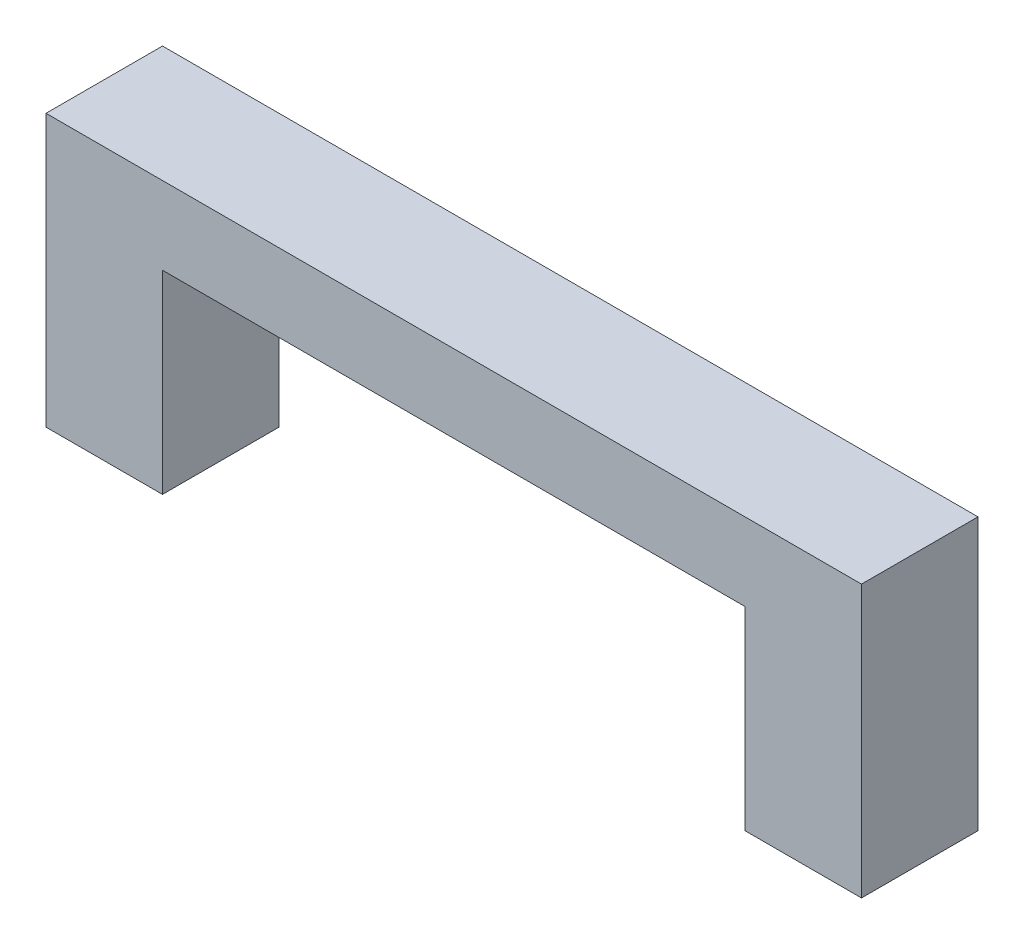
ISO-10303-21;
HEADER;
FILE_DESCRIPTION(('STEP AP214'),'2;1');
FILE_NAME('part.step','',(''),(''),'','','');
FILE_SCHEMA(('AUTOMOTIVE_DESIGN { 1 0 10303 214 1 1 1 1 }'));
ENDSEC;
DATA;
#1=APPLICATION_CONTEXT('core data for automotive mechanical design processes');
#2=APPLICATION_PROTOCOL_DEFINITION('international standard','automotive_design',2000,#1);
#3=PRODUCT_CONTEXT('',#1,'mechanical');
#4=PRODUCT('Part','Part','',(#3));
#5=PRODUCT_RELATED_PRODUCT_CATEGORY('part','',(#4));
#6=PRODUCT_DEFINITION_FORMATION('','',#4);
#7=PRODUCT_DEFINITION_CONTEXT('part definition',#1,'design');
#8=PRODUCT_DEFINITION('design','',#6,#7);
#9=PRODUCT_DEFINITION_SHAPE('','',#8);
#10=(LENGTH_UNIT() NAMED_UNIT(*) SI_UNIT(.MILLI.,.METRE.));
#11=(NAMED_UNIT(*) PLANE_ANGLE_UNIT() SI_UNIT($,.RADIAN.));
#12=(NAMED_UNIT(*) SI_UNIT($,.STERADIAN.) SOLID_ANGLE_UNIT());
#13=UNCERTAINTY_MEASURE_WITH_UNIT(LENGTH_MEASURE(1.E-05),#10,'distance_accuracy_value','');
#14=(GEOMETRIC_REPRESENTATION_CONTEXT(3) GLOBAL_UNCERTAINTY_ASSIGNED_CONTEXT((#13)) GLOBAL_UNIT_ASSIGNED_CONTEXT((#10,
#11,#12)) REPRESENTATION_CONTEXT('',''));
#15=CARTESIAN_POINT('',(0.,0.,0.));
#16=DIRECTION('',(0.,0.,1.));
#17=DIRECTION('',(1.,0.,0.));
#18=AXIS2_PLACEMENT_3D('',#15,#16,#17);
#19=CARTESIAN_POINT('',(21.,0.,3.));
#20=DIRECTION('',(0.,1.,0.));
#21=DIRECTION('',(-1.,0.,0.));
#22=AXIS2_PLACEMENT_3D('',#19,#20,#21);
#23=PLANE('',#22);
#24=DIRECTION('',(1.,0.,0.));
#25=VECTOR('',#24,1.);
#26=CARTESIAN_POINT('',(21.,0.,0.));
#27=LINE('',#26,#25);
#28=CARTESIAN_POINT('',(18.,0.,0.));
#29=VERTEX_POINT('',#28);
#30=CARTESIAN_POINT('',(21.,0.,0.));
#31=VERTEX_POINT('',#30);
#32=EDGE_CURVE('E236',#29,#31,#27,.T.);
#33=ORIENTED_EDGE('',*,*,#32,.T.);
#34=DIRECTION('',(0.,0.,-1.));
#35=VECTOR('',#34,1.);
#36=CARTESIAN_POINT('',(21.,0.,3.));
#37=LINE('',#36,#35);
#38=CARTESIAN_POINT('',(21.,0.,3.));
#39=VERTEX_POINT('',#38);
#40=EDGE_CURVE('E251',#39,#31,#37,.T.);
#41=ORIENTED_EDGE('',*,*,#40,.F.);
#42=DIRECTION('',(1.,0.,0.));
#43=VECTOR('',#42,1.);
#44=CARTESIAN_POINT('',(21.,0.,3.));
#45=LINE('',#44,#43);
#46=CARTESIAN_POINT('',(18.,0.,3.));
#47=VERTEX_POINT('',#46);
#48=EDGE_CURVE('E219',#47,#39,#45,.T.);
#49=ORIENTED_EDGE('',*,*,#48,.F.);
#50=DIRECTION('',(0.,0.,-1.));
#51=VECTOR('',#50,1.);
#52=CARTESIAN_POINT('',(18.,0.,3.));
#53=LINE('',#52,#51);
#54=EDGE_CURVE('E254',#47,#29,#53,.T.);
#55=ORIENTED_EDGE('',*,*,#54,.T.);
#56=EDGE_LOOP('',(#33,#41,#49,#55));
#57=FACE_BOUND('',#56,.T.);
#58=DIRECTION('',(0.,0.,-1.));
#59=VECTOR('',#58,1.);
#60=CARTESIAN_POINT('',(20.5,0.,0.));
#61=LINE('',#60,#59);
#62=CARTESIAN_POINT('',(20.5,0.,2.5));
#63=VERTEX_POINT('',#62);
#64=CARTESIAN_POINT('',(20.5,0.,0.500000000000001));
#65=VERTEX_POINT('',#64);
#66=EDGE_CURVE('E56',#63,#65,#61,.T.);
#67=ORIENTED_EDGE('',*,*,#66,.T.);
#68=DIRECTION('',(1.,0.,0.));
#69=VECTOR('',#68,1.);
#70=CARTESIAN_POINT('',(0.,0.,0.500000000000001));
#71=LINE('',#70,#69);
#72=CARTESIAN_POINT('',(18.5,0.,0.500000000000001));
#73=VERTEX_POINT('',#72);
#74=EDGE_CURVE('E185',#73,#65,#71,.T.);
#75=ORIENTED_EDGE('',*,*,#74,.F.);
#76=DIRECTION('',(0.,0.,-1.));
#77=VECTOR('',#76,1.);
#78=CARTESIAN_POINT('',(18.5,0.,0.));
#79=LINE('',#78,#77);
#80=CARTESIAN_POINT('',(18.5,0.,2.5));
#81=VERTEX_POINT('',#80);
#82=EDGE_CURVE('E196',#81,#73,#79,.T.);
#83=ORIENTED_EDGE('',*,*,#82,.F.);
#84=DIRECTION('',(1.,0.,0.));
#85=VECTOR('',#84,1.);
#86=CARTESIAN_POINT('',(0.,0.,2.5));
#87=LINE('',#86,#85);
#88=EDGE_CURVE('E168',#81,#63,#87,.T.);
#89=ORIENTED_EDGE('',*,*,#88,.T.);
#90=EDGE_LOOP('',(#67,#75,#83,#89));
#91=FACE_BOUND('',#90,.T.);
#92=ADVANCED_FACE('F33',(#57,#91),#23,.F.);
#93=CARTESIAN_POINT('',(3.,0.,3.));
#94=DIRECTION('',(0.,1.,0.));
#95=DIRECTION('',(-1.,0.,0.));
#96=AXIS2_PLACEMENT_3D('',#93,#94,#95);
#97=PLANE('',#96);
#98=DIRECTION('',(1.,0.,0.));
#99=VECTOR('',#98,1.);
#100=CARTESIAN_POINT('',(0.5,0.,0.5));
#101=LINE('',#100,#99);
#102=CARTESIAN_POINT('',(0.5,0.,0.5));
#103=VERTEX_POINT('',#102);
#104=CARTESIAN_POINT('',(2.5,0.,0.5));
#105=VERTEX_POINT('',#104);
#106=EDGE_CURVE('E166',#103,#105,#101,.T.);
#107=ORIENTED_EDGE('',*,*,#106,.F.);
#108=DIRECTION('',(0.,0.,-1.));
#109=VECTOR('',#108,1.);
#110=CARTESIAN_POINT('',(0.5,0.,2.5));
#111=LINE('',#110,#109);
#112=CARTESIAN_POINT('',(0.5,0.,2.5));
#113=VERTEX_POINT('',#112);
#114=EDGE_CURVE('E48',#113,#103,#111,.T.);
#115=ORIENTED_EDGE('',*,*,#114,.F.);
#116=DIRECTION('',(1.,0.,0.));
#117=VECTOR('',#116,1.);
#118=CARTESIAN_POINT('',(0.5,0.,2.5));
#119=LINE('',#118,#117);
#120=CARTESIAN_POINT('',(2.5,0.,2.5));
#121=VERTEX_POINT('',#120);
#122=EDGE_CURVE('E155',#113,#121,#119,.T.);
#123=ORIENTED_EDGE('',*,*,#122,.T.);
#124=DIRECTION('',(0.,0.,-1.));
#125=VECTOR('',#124,1.);
#126=CARTESIAN_POINT('',(2.5,0.,2.5));
#127=LINE('',#126,#125);
#128=EDGE_CURVE('E161',#121,#105,#127,.T.);
#129=ORIENTED_EDGE('',*,*,#128,.T.);
#130=EDGE_LOOP('',(#107,#115,#123,#129));
#131=FACE_BOUND('',#130,.T.);
#132=DIRECTION('',(1.,0.,0.));
#133=VECTOR('',#132,1.);
#134=CARTESIAN_POINT('',(3.,0.,0.));
#135=LINE('',#134,#133);
#136=CARTESIAN_POINT('',(0.,0.,0.));
#137=VERTEX_POINT('',#136);
#138=CARTESIAN_POINT('',(3.,0.,0.));
#139=VERTEX_POINT('',#138);
#140=EDGE_CURVE('E203',#137,#139,#135,.T.);
#141=ORIENTED_EDGE('',*,*,#140,.T.);
#142=DIRECTION('',(0.,0.,-1.));
#143=VECTOR('',#142,1.);
#144=CARTESIAN_POINT('',(3.,0.,3.));
#145=LINE('',#144,#143);
#146=CARTESIAN_POINT('',(3.,0.,3.));
#147=VERTEX_POINT('',#146);
#148=EDGE_CURVE('E11',#147,#139,#145,.T.);
#149=ORIENTED_EDGE('',*,*,#148,.F.);
#150=DIRECTION('',(1.,0.,0.));
#151=VECTOR('',#150,1.);
#152=CARTESIAN_POINT('',(3.,0.,3.));
#153=LINE('',#152,#151);
#154=CARTESIAN_POINT('',(0.,0.,3.));
#155=VERTEX_POINT('',#154);
#156=EDGE_CURVE('E209',#155,#147,#153,.T.);
#157=ORIENTED_EDGE('',*,*,#156,.F.);
#158=DIRECTION('',(0.,0.,-1.));
#159=VECTOR('',#158,1.);
#160=CARTESIAN_POINT('',(0.,0.,3.));
#161=LINE('',#160,#159);
#162=EDGE_CURVE('E227',#155,#137,#161,.T.);
#163=ORIENTED_EDGE('',*,*,#162,.T.);
#164=EDGE_LOOP('',(#141,#149,#157,#163));
#165=FACE_BOUND('',#164,.T.);
#166=ADVANCED_FACE('F35',(#131,#165),#97,.F.);
#167=CARTESIAN_POINT('',(3.,5.,3.));
#168=DIRECTION('',(-1.,0.,0.));
#169=DIRECTION('',(0.,-1.,0.));
#170=AXIS2_PLACEMENT_3D('',#167,#168,#169);
#171=PLANE('',#170);
#172=DIRECTION('',(0.,1.,0.));
#173=VECTOR('',#172,1.);
#174=CARTESIAN_POINT('',(3.,5.,0.));
#175=LINE('',#174,#173);
#176=CARTESIAN_POINT('',(3.,5.,0.));
#177=VERTEX_POINT('',#176);
#178=EDGE_CURVE('E230',#139,#177,#175,.T.);
#179=ORIENTED_EDGE('',*,*,#178,.T.);
#180=DIRECTION('',(0.,0.,-1.));
#181=VECTOR('',#180,1.);
#182=CARTESIAN_POINT('',(3.,5.,3.));
#183=LINE('',#182,#181);
#184=CARTESIAN_POINT('',(3.,5.,3.));
#185=VERTEX_POINT('',#184);
#186=EDGE_CURVE('E41',#185,#177,#183,.T.);
#187=ORIENTED_EDGE('',*,*,#186,.F.);
#188=DIRECTION('',(0.,1.,0.));
#189=VECTOR('',#188,1.);
#190=CARTESIAN_POINT('',(3.,5.,3.));
#191=LINE('',#190,#189);
#192=EDGE_CURVE('E212',#147,#185,#191,.T.);
#193=ORIENTED_EDGE('',*,*,#192,.F.);
#194=ORIENTED_EDGE('',*,*,#148,.T.);
#195=EDGE_LOOP('',(#179,#187,#193,#194));
#196=FACE_BOUND('',#195,.T.);
#197=ADVANCED_FACE('F287',(#196),#171,.F.);
#198=CARTESIAN_POINT('',(18.,5.,3.));
#199=DIRECTION('',(0.,1.,0.));
#200=DIRECTION('',(-1.,0.,0.));
#201=AXIS2_PLACEMENT_3D('',#198,#199,#200);
#202=PLANE('',#201);
#203=DIRECTION('',(1.,0.,0.));
#204=VECTOR('',#203,1.);
#205=CARTESIAN_POINT('',(18.,5.,0.));
#206=LINE('',#205,#204);
#207=CARTESIAN_POINT('',(18.,5.,0.));
#208=VERTEX_POINT('',#207);
#209=EDGE_CURVE('E232',#177,#208,#206,.T.);
#210=ORIENTED_EDGE('',*,*,#209,.T.);
#211=DIRECTION('',(0.,0.,-1.));
#212=VECTOR('',#211,1.);
#213=CARTESIAN_POINT('',(18.,5.,3.));
#214=LINE('',#213,#212);
#215=CARTESIAN_POINT('',(18.,5.,3.));
#216=VERTEX_POINT('',#215);
#217=EDGE_CURVE('E257',#216,#208,#214,.T.);
#218=ORIENTED_EDGE('',*,*,#217,.F.);
#219=DIRECTION('',(1.,0.,0.));
#220=VECTOR('',#219,1.);
#221=CARTESIAN_POINT('',(18.,5.,3.));
#222=LINE('',#221,#220);
#223=EDGE_CURVE('E215',#185,#216,#222,.T.);
#224=ORIENTED_EDGE('',*,*,#223,.F.);
#225=ORIENTED_EDGE('',*,*,#186,.T.);
#226=EDGE_LOOP('',(#210,#218,#224,#225));
#227=FACE_BOUND('',#226,.T.);
#228=ADVANCED_FACE('F264',(#227),#202,.F.);
#229=CARTESIAN_POINT('',(18.,0.,3.));
#230=DIRECTION('',(1.,0.,0.));
#231=DIRECTION('',(0.,0.,-1.));
#232=AXIS2_PLACEMENT_3D('',#229,#230,#231);
#233=PLANE('',#232);
#234=DIRECTION('',(0.,-1.,0.));
#235=VECTOR('',#234,1.);
#236=CARTESIAN_POINT('',(18.,0.,0.));
#237=LINE('',#236,#235);
#238=EDGE_CURVE('E234',#208,#29,#237,.T.);
#239=ORIENTED_EDGE('',*,*,#238,.T.);
#240=ORIENTED_EDGE('',*,*,#54,.F.);
#241=DIRECTION('',(0.,-1.,0.));
#242=VECTOR('',#241,1.);
#243=CARTESIAN_POINT('',(18.,0.,3.));
#244=LINE('',#243,#242);
#245=EDGE_CURVE('E217',#216,#47,#244,.T.);
#246=ORIENTED_EDGE('',*,*,#245,.F.);
#247=ORIENTED_EDGE('',*,*,#217,.T.);
#248=EDGE_LOOP('',(#239,#240,#246,#247));
#249=FACE_BOUND('',#248,.T.);
#250=ADVANCED_FACE('F275',(#249),#233,.F.);
#251=CARTESIAN_POINT('',(21.,7.,3.));
#252=DIRECTION('',(-1.,0.,0.));
#253=DIRECTION('',(0.,0.,1.));
#254=AXIS2_PLACEMENT_3D('',#251,#252,#253);
#255=PLANE('',#254);
#256=DIRECTION('',(0.,1.,0.));
#257=VECTOR('',#256,1.);
#258=CARTESIAN_POINT('',(21.,7.,0.));
#259=LINE('',#258,#257);
#260=CARTESIAN_POINT('',(21.,7.,0.));
#261=VERTEX_POINT('',#260);
#262=EDGE_CURVE('E238',#31,#261,#259,.T.);
#263=ORIENTED_EDGE('',*,*,#262,.T.);
#264=DIRECTION('',(0.,0.,-1.));
#265=VECTOR('',#264,1.);
#266=CARTESIAN_POINT('',(21.,7.,3.));
#267=LINE('',#266,#265);
#268=CARTESIAN_POINT('',(21.,7.,3.));
#269=VERTEX_POINT('',#268);
#270=EDGE_CURVE('E248',#269,#261,#267,.T.);
#271=ORIENTED_EDGE('',*,*,#270,.F.);
#272=DIRECTION('',(0.,1.,0.));
#273=VECTOR('',#272,1.);
#274=CARTESIAN_POINT('',(21.,7.,3.));
#275=LINE('',#274,#273);
#276=EDGE_CURVE('E221',#39,#269,#275,.T.);
#277=ORIENTED_EDGE('',*,*,#276,.F.);
#278=ORIENTED_EDGE('',*,*,#40,.T.);
#279=EDGE_LOOP('',(#263,#271,#277,#278));
#280=FACE_BOUND('',#279,.T.);
#281=ADVANCED_FACE('F299',(#280),#255,.F.);
#282=CARTESIAN_POINT('',(0.,7.,3.));
#283=DIRECTION('',(0.,-1.,0.));
#284=DIRECTION('',(0.,0.,-1.));
#285=AXIS2_PLACEMENT_3D('',#282,#283,#284);
#286=PLANE('',#285);
#287=DIRECTION('',(-1.,0.,0.));
#288=VECTOR('',#287,1.);
#289=CARTESIAN_POINT('',(0.,7.,0.));
#290=LINE('',#289,#288);
#291=CARTESIAN_POINT('',(0.,7.,0.));
#292=VERTEX_POINT('',#291);
#293=EDGE_CURVE('E240',#261,#292,#290,.T.);
#294=ORIENTED_EDGE('',*,*,#293,.T.);
#295=DIRECTION('',(0.,0.,-1.));
#296=VECTOR('',#295,1.);
#297=CARTESIAN_POINT('',(0.,7.,3.));
#298=LINE('',#297,#296);
#299=CARTESIAN_POINT('',(0.,7.,3.));
#300=VERTEX_POINT('',#299);
#301=EDGE_CURVE('E245',#300,#292,#298,.T.);
#302=ORIENTED_EDGE('',*,*,#301,.F.);
#303=DIRECTION('',(-1.,0.,0.));
#304=VECTOR('',#303,1.);
#305=CARTESIAN_POINT('',(0.,7.,3.));
#306=LINE('',#305,#304);
#307=EDGE_CURVE('E223',#269,#300,#306,.T.);
#308=ORIENTED_EDGE('',*,*,#307,.F.);
#309=ORIENTED_EDGE('',*,*,#270,.T.);
#310=EDGE_LOOP('',(#294,#302,#308,#309));
#311=FACE_BOUND('',#310,.T.);
#312=ADVANCED_FACE('F297',(#311),#286,.F.);
#313=CARTESIAN_POINT('',(0.,0.,3.));
#314=DIRECTION('',(1.,0.,0.));
#315=DIRECTION('',(0.,0.,-1.));
#316=AXIS2_PLACEMENT_3D('',#313,#314,#315);
#317=PLANE('',#316);
#318=DIRECTION('',(0.,-1.,0.));
#319=VECTOR('',#318,1.);
#320=CARTESIAN_POINT('',(0.,0.,0.));
#321=LINE('',#320,#319);
#322=EDGE_CURVE('E213',#292,#137,#321,.T.);
#323=ORIENTED_EDGE('',*,*,#322,.T.);
#324=ORIENTED_EDGE('',*,*,#162,.F.);
#325=DIRECTION('',(0.,-1.,0.));
#326=VECTOR('',#325,1.);
#327=CARTESIAN_POINT('',(0.,0.,3.));
#328=LINE('',#327,#326);
#329=EDGE_CURVE('E225',#300,#155,#328,.T.);
#330=ORIENTED_EDGE('',*,*,#329,.F.);
#331=ORIENTED_EDGE('',*,*,#301,.T.);
#332=EDGE_LOOP('',(#323,#324,#330,#331));
#333=FACE_BOUND('',#332,.T.);
#334=ADVANCED_FACE('F292',(#333),#317,.F.);
#335=CARTESIAN_POINT('',(0.,0.,3.));
#336=DIRECTION('',(0.,0.,-1.));
#337=DIRECTION('',(-1.,0.,0.));
#338=AXIS2_PLACEMENT_3D('',#335,#336,#337);
#339=PLANE('',#338);
#340=ORIENTED_EDGE('',*,*,#156,.T.);
#341=ORIENTED_EDGE('',*,*,#192,.T.);
#342=ORIENTED_EDGE('',*,*,#223,.T.);
#343=ORIENTED_EDGE('',*,*,#245,.T.);
#344=ORIENTED_EDGE('',*,*,#48,.T.);
#345=ORIENTED_EDGE('',*,*,#276,.T.);
#346=ORIENTED_EDGE('',*,*,#307,.T.);
#347=ORIENTED_EDGE('',*,*,#329,.T.);
#348=EDGE_LOOP('',(#340,#341,#342,#343,#344,#345,#346,#347));
#349=FACE_BOUND('',#348,.T.);
#350=ADVANCED_FACE('F283',(#349),#339,.F.);
#351=CARTESIAN_POINT('',(0.,0.,0.));
#352=DIRECTION('',(0.,0.,-1.));
#353=DIRECTION('',(-1.,0.,0.));
#354=AXIS2_PLACEMENT_3D('',#351,#352,#353);
#355=PLANE('',#354);
#356=ORIENTED_EDGE('',*,*,#140,.F.);
#357=ORIENTED_EDGE('',*,*,#322,.F.);
#358=ORIENTED_EDGE('',*,*,#293,.F.);
#359=ORIENTED_EDGE('',*,*,#262,.F.);
#360=ORIENTED_EDGE('',*,*,#32,.F.);
#361=ORIENTED_EDGE('',*,*,#238,.F.);
#362=ORIENTED_EDGE('',*,*,#209,.F.);
#363=ORIENTED_EDGE('',*,*,#178,.F.);
#364=EDGE_LOOP('',(#356,#357,#358,#359,#360,#361,#362,#363));
#365=FACE_BOUND('',#364,.T.);
#366=ADVANCED_FACE('F270',(#365),#355,.T.);
#367=CARTESIAN_POINT('',(20.5,2.2,0.));
#368=DIRECTION('',(-1.,0.,0.));
#369=DIRECTION('',(0.,0.,1.));
#370=AXIS2_PLACEMENT_3D('',#367,#368,#369);
#371=PLANE('',#370);
#372=ORIENTED_EDGE('',*,*,#66,.F.);
#373=DIRECTION('',(0.,-1.,0.));
#374=VECTOR('',#373,1.);
#375=CARTESIAN_POINT('',(20.5,2.2,2.5));
#376=LINE('',#375,#374);
#377=CARTESIAN_POINT('',(20.5,2.2,2.5));
#378=VERTEX_POINT('',#377);
#379=EDGE_CURVE('E192',#378,#63,#376,.T.);
#380=ORIENTED_EDGE('',*,*,#379,.F.);
#381=DIRECTION('',(0.,0.,-1.));
#382=VECTOR('',#381,1.);
#383=CARTESIAN_POINT('',(20.5,2.2,0.));
#384=LINE('',#383,#382);
#385=CARTESIAN_POINT('',(20.5,2.2,0.500000000000001));
#386=VERTEX_POINT('',#385);
#387=EDGE_CURVE('E182',#378,#386,#384,.T.);
#388=ORIENTED_EDGE('',*,*,#387,.T.);
#389=DIRECTION('',(0.,-1.,0.));
#390=VECTOR('',#389,1.);
#391=CARTESIAN_POINT('',(20.5,2.2,0.500000000000001));
#392=LINE('',#391,#390);
#393=EDGE_CURVE('E201',#386,#65,#392,.T.);
#394=ORIENTED_EDGE('',*,*,#393,.T.);
#395=EDGE_LOOP('',(#372,#380,#388,#394));
#396=FACE_BOUND('',#395,.T.);
#397=ADVANCED_FACE('F362',(#396),#371,.T.);
#398=CARTESIAN_POINT('',(0.,2.2,0.500000000000001));
#399=DIRECTION('',(0.,0.,-1.));
#400=DIRECTION('',(-1.,0.,0.));
#401=AXIS2_PLACEMENT_3D('',#398,#399,#400);
#402=PLANE('',#401);
#403=ORIENTED_EDGE('',*,*,#74,.T.);
#404=ORIENTED_EDGE('',*,*,#393,.F.);
#405=DIRECTION('',(1.,0.,0.));
#406=VECTOR('',#405,1.);
#407=CARTESIAN_POINT('',(0.,2.2,0.500000000000001));
#408=LINE('',#407,#406);
#409=CARTESIAN_POINT('',(18.5,2.2,0.500000000000001));
#410=VERTEX_POINT('',#409);
#411=EDGE_CURVE('E190',#410,#386,#408,.T.);
#412=ORIENTED_EDGE('',*,*,#411,.F.);
#413=DIRECTION('',(0.,-1.,0.));
#414=VECTOR('',#413,1.);
#415=CARTESIAN_POINT('',(18.5,2.2,0.500000000000001));
#416=LINE('',#415,#414);
#417=EDGE_CURVE('E204',#410,#73,#416,.T.);
#418=ORIENTED_EDGE('',*,*,#417,.T.);
#419=EDGE_LOOP('',(#403,#404,#412,#418));
#420=FACE_BOUND('',#419,.T.);
#421=ADVANCED_FACE('F380',(#420),#402,.F.);
#422=CARTESIAN_POINT('',(18.5,2.2,0.));
#423=DIRECTION('',(-1.,0.,0.));
#424=DIRECTION('',(0.,0.,1.));
#425=AXIS2_PLACEMENT_3D('',#422,#423,#424);
#426=PLANE('',#425);
#427=ORIENTED_EDGE('',*,*,#82,.T.);
#428=ORIENTED_EDGE('',*,*,#417,.F.);
#429=DIRECTION('',(0.,0.,-1.));
#430=VECTOR('',#429,1.);
#431=CARTESIAN_POINT('',(18.5,2.2,0.));
#432=LINE('',#431,#430);
#433=CARTESIAN_POINT('',(18.5,2.2,2.5));
#434=VERTEX_POINT('',#433);
#435=EDGE_CURVE('E187',#434,#410,#432,.T.);
#436=ORIENTED_EDGE('',*,*,#435,.F.);
#437=DIRECTION('',(0.,-1.,0.));
#438=VECTOR('',#437,1.);
#439=CARTESIAN_POINT('',(18.5,2.2,2.5));
#440=LINE('',#439,#438);
#441=EDGE_CURVE('E206',#434,#81,#440,.T.);
#442=ORIENTED_EDGE('',*,*,#441,.T.);
#443=EDGE_LOOP('',(#427,#428,#436,#442));
#444=FACE_BOUND('',#443,.T.);
#445=ADVANCED_FACE('F389',(#444),#426,.F.);
#446=CARTESIAN_POINT('',(0.,2.2,2.5));
#447=DIRECTION('',(0.,0.,-1.));
#448=DIRECTION('',(-1.,0.,0.));
#449=AXIS2_PLACEMENT_3D('',#446,#447,#448);
#450=PLANE('',#449);
#451=ORIENTED_EDGE('',*,*,#88,.F.);
#452=ORIENTED_EDGE('',*,*,#441,.F.);
#453=DIRECTION('',(1.,0.,0.));
#454=VECTOR('',#453,1.);
#455=CARTESIAN_POINT('',(0.,2.2,2.5));
#456=LINE('',#455,#454);
#457=EDGE_CURVE('E184',#434,#378,#456,.T.);
#458=ORIENTED_EDGE('',*,*,#457,.T.);
#459=ORIENTED_EDGE('',*,*,#379,.T.);
#460=EDGE_LOOP('',(#451,#452,#458,#459));
#461=FACE_BOUND('',#460,.T.);
#462=ADVANCED_FACE('F399',(#461),#450,.T.);
#463=CARTESIAN_POINT('',(0.,2.2,0.));
#464=DIRECTION('',(0.,-1.,0.));
#465=DIRECTION('',(0.,0.,-1.));
#466=AXIS2_PLACEMENT_3D('',#463,#464,#465);
#467=PLANE('',#466);
#468=ORIENTED_EDGE('',*,*,#387,.F.);
#469=ORIENTED_EDGE('',*,*,#457,.F.);
#470=ORIENTED_EDGE('',*,*,#435,.T.);
#471=ORIENTED_EDGE('',*,*,#411,.T.);
#472=EDGE_LOOP('',(#468,#469,#470,#471));
#473=FACE_BOUND('',#472,.T.);
#474=ADVANCED_FACE('F409',(#473),#467,.T.);
#475=CARTESIAN_POINT('',(0.5,2.2,2.5));
#476=DIRECTION('',(-1.,0.,0.));
#477=DIRECTION('',(0.,0.,1.));
#478=AXIS2_PLACEMENT_3D('',#475,#476,#477);
#479=PLANE('',#478);
#480=ORIENTED_EDGE('',*,*,#114,.T.);
#481=DIRECTION('',(0.,-1.,0.));
#482=VECTOR('',#481,1.);
#483=CARTESIAN_POINT('',(0.5,2.2,0.5));
#484=LINE('',#483,#482);
#485=CARTESIAN_POINT('',(0.5,2.2,0.5));
#486=VERTEX_POINT('',#485);
#487=EDGE_CURVE('E176',#486,#103,#484,.T.);
#488=ORIENTED_EDGE('',*,*,#487,.F.);
#489=DIRECTION('',(0.,0.,-1.));
#490=VECTOR('',#489,1.);
#491=CARTESIAN_POINT('',(0.5,2.2,2.5));
#492=LINE('',#491,#490);
#493=CARTESIAN_POINT('',(0.5,2.2,2.5));
#494=VERTEX_POINT('',#493);
#495=EDGE_CURVE('E149',#494,#486,#492,.T.);
#496=ORIENTED_EDGE('',*,*,#495,.F.);
#497=DIRECTION('',(0.,-1.,0.));
#498=VECTOR('',#497,1.);
#499=CARTESIAN_POINT('',(0.5,2.2,2.5));
#500=LINE('',#499,#498);
#501=EDGE_CURVE('E145',#494,#113,#500,.T.);
#502=ORIENTED_EDGE('',*,*,#501,.T.);
#503=EDGE_LOOP('',(#480,#488,#496,#502));
#504=FACE_BOUND('',#503,.T.);
#505=ADVANCED_FACE('F147',(#504),#479,.F.);
#506=CARTESIAN_POINT('',(0.5,2.2,2.5));
#507=DIRECTION('',(0.,0.,-1.));
#508=DIRECTION('',(-1.,0.,0.));
#509=AXIS2_PLACEMENT_3D('',#506,#507,#508);
#510=PLANE('',#509);
#511=ORIENTED_EDGE('',*,*,#122,.F.);
#512=ORIENTED_EDGE('',*,*,#501,.F.);
#513=DIRECTION('',(1.,0.,0.));
#514=VECTOR('',#513,1.);
#515=CARTESIAN_POINT('',(0.5,2.2,2.5));
#516=LINE('',#515,#514);
#517=CARTESIAN_POINT('',(2.5,2.2,2.5));
#518=VERTEX_POINT('',#517);
#519=EDGE_CURVE('E173',#494,#518,#516,.T.);
#520=ORIENTED_EDGE('',*,*,#519,.T.);
#521=DIRECTION('',(0.,-1.,0.));
#522=VECTOR('',#521,1.);
#523=CARTESIAN_POINT('',(2.5,2.2,2.5));
#524=LINE('',#523,#522);
#525=EDGE_CURVE('E152',#518,#121,#524,.T.);
#526=ORIENTED_EDGE('',*,*,#525,.T.);
#527=EDGE_LOOP('',(#511,#512,#520,#526));
#528=FACE_BOUND('',#527,.T.);
#529=ADVANCED_FACE('F156',(#528),#510,.T.);
#530=CARTESIAN_POINT('',(2.5,2.2,2.5));
#531=DIRECTION('',(-1.,0.,0.));
#532=DIRECTION('',(0.,0.,1.));
#533=AXIS2_PLACEMENT_3D('',#530,#531,#532);
#534=PLANE('',#533);
#535=ORIENTED_EDGE('',*,*,#128,.F.);
#536=ORIENTED_EDGE('',*,*,#525,.F.);
#537=DIRECTION('',(0.,0.,-1.));
#538=VECTOR('',#537,1.);
#539=CARTESIAN_POINT('',(2.5,2.2,2.5));
#540=LINE('',#539,#538);
#541=CARTESIAN_POINT('',(2.5,2.2,0.5));
#542=VERTEX_POINT('',#541);
#543=EDGE_CURVE('E175',#518,#542,#540,.T.);
#544=ORIENTED_EDGE('',*,*,#543,.T.);
#545=DIRECTION('',(0.,-1.,0.));
#546=VECTOR('',#545,1.);
#547=CARTESIAN_POINT('',(2.5,2.2,0.5));
#548=LINE('',#547,#546);
#549=EDGE_CURVE('E472',#542,#105,#548,.T.);
#550=ORIENTED_EDGE('',*,*,#549,.T.);
#551=EDGE_LOOP('',(#535,#536,#544,#550));
#552=FACE_BOUND('',#551,.T.);
#553=ADVANCED_FACE('F436',(#552),#534,.T.);
#554=CARTESIAN_POINT('',(0.5,2.2,0.5));
#555=DIRECTION('',(0.,0.,-1.));
#556=DIRECTION('',(-1.,0.,0.));
#557=AXIS2_PLACEMENT_3D('',#554,#555,#556);
#558=PLANE('',#557);
#559=ORIENTED_EDGE('',*,*,#106,.T.);
#560=ORIENTED_EDGE('',*,*,#549,.F.);
#561=DIRECTION('',(1.,0.,0.));
#562=VECTOR('',#561,1.);
#563=CARTESIAN_POINT('',(0.5,2.2,0.5));
#564=LINE('',#563,#562);
#565=EDGE_CURVE('E178',#486,#542,#564,.T.);
#566=ORIENTED_EDGE('',*,*,#565,.F.);
#567=ORIENTED_EDGE('',*,*,#487,.T.);
#568=EDGE_LOOP('',(#559,#560,#566,#567));
#569=FACE_BOUND('',#568,.T.);
#570=ADVANCED_FACE('F445',(#569),#558,.F.);
#571=CARTESIAN_POINT('',(0.,2.2,0.));
#572=DIRECTION('',(0.,-1.,0.));
#573=DIRECTION('',(0.,0.,-1.));
#574=AXIS2_PLACEMENT_3D('',#571,#572,#573);
#575=PLANE('',#574);
#576=ORIENTED_EDGE('',*,*,#495,.T.);
#577=ORIENTED_EDGE('',*,*,#565,.T.);
#578=ORIENTED_EDGE('',*,*,#543,.F.);
#579=ORIENTED_EDGE('',*,*,#519,.F.);
#580=EDGE_LOOP('',(#576,#577,#578,#579));
#581=FACE_BOUND('',#580,.T.);
#582=ADVANCED_FACE('F455',(#581),#575,.T.);
#583=CLOSED_SHELL('',(#92,#166,#197,#228,#250,#281,#312,#334,#350,#366,#397,#421,#445,#462,#474,
#505,#529,#553,#570,#582));
#584=MANIFOLD_SOLID_BREP('B2',#583);
#585=ADVANCED_BREP_SHAPE_REPRESENTATION('',(#18,#584),#14);
#586=SHAPE_DEFINITION_REPRESENTATION(#9,#585);
ENDSEC;
END-ISO-10303-21;
